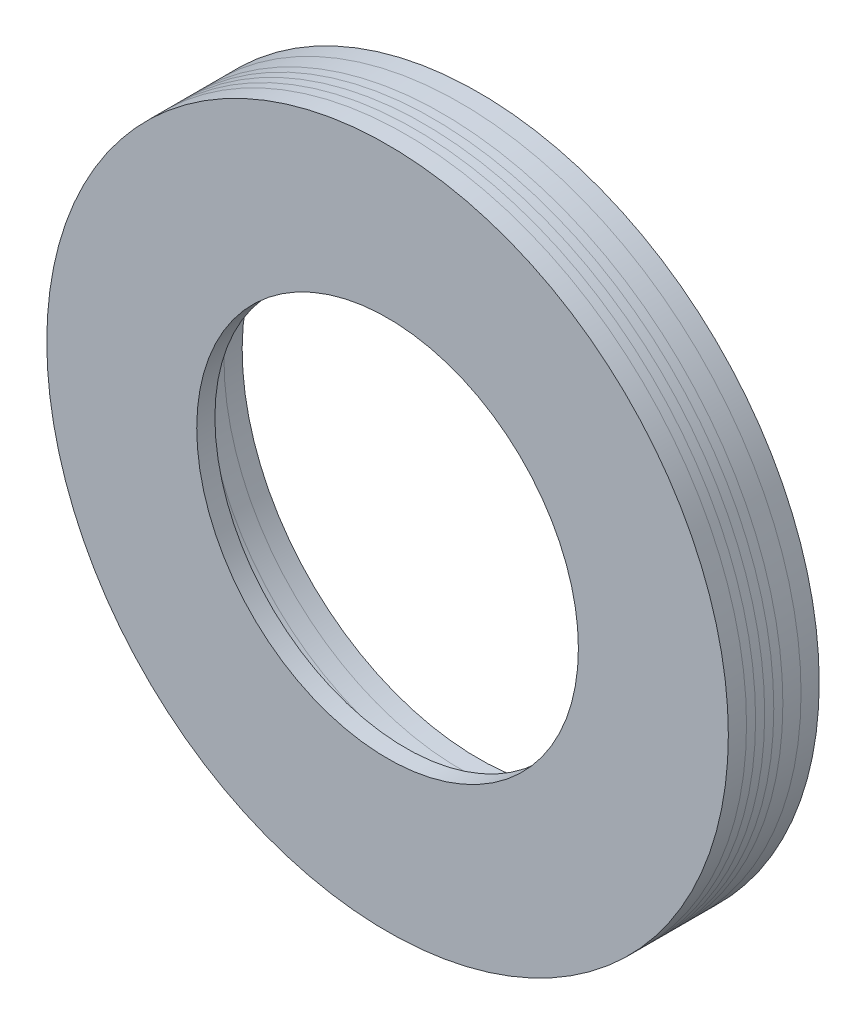
ISO-10303-21;
HEADER;
FILE_DESCRIPTION(('STEP AP214'),'2;1');
FILE_NAME('part.step','',(''),(''),'','','');
FILE_SCHEMA(('AUTOMOTIVE_DESIGN { 1 0 10303 214 1 1 1 1 }'));
ENDSEC;
DATA;
#1=APPLICATION_CONTEXT('core data for automotive mechanical design processes');
#2=APPLICATION_PROTOCOL_DEFINITION('international standard','automotive_design',2000,#1);
#3=PRODUCT_CONTEXT('',#1,'mechanical');
#4=PRODUCT('Part','Part','',(#3));
#5=PRODUCT_RELATED_PRODUCT_CATEGORY('part','',(#4));
#6=PRODUCT_DEFINITION_FORMATION('','',#4);
#7=PRODUCT_DEFINITION_CONTEXT('part definition',#1,'design');
#8=PRODUCT_DEFINITION('design','',#6,#7);
#9=PRODUCT_DEFINITION_SHAPE('','',#8);
#10=(LENGTH_UNIT() NAMED_UNIT(*) SI_UNIT(.MILLI.,.METRE.));
#11=(NAMED_UNIT(*) PLANE_ANGLE_UNIT() SI_UNIT($,.RADIAN.));
#12=(NAMED_UNIT(*) SI_UNIT($,.STERADIAN.) SOLID_ANGLE_UNIT());
#13=UNCERTAINTY_MEASURE_WITH_UNIT(LENGTH_MEASURE(1.E-05),#10,'distance_accuracy_value','');
#14=(GEOMETRIC_REPRESENTATION_CONTEXT(3) GLOBAL_UNCERTAINTY_ASSIGNED_CONTEXT((#13)) GLOBAL_UNIT_ASSIGNED_CONTEXT((#10,
#11,#12)) REPRESENTATION_CONTEXT('',''));
#15=CARTESIAN_POINT('',(0.,0.,0.));
#16=DIRECTION('',(0.,0.,1.));
#17=DIRECTION('',(1.,0.,0.));
#18=AXIS2_PLACEMENT_3D('',#15,#16,#17);
#19=CARTESIAN_POINT('',(0.,0.,5.));
#20=DIRECTION('',(0.,0.,1.));
#21=DIRECTION('',(1.,0.,0.));
#22=AXIS2_PLACEMENT_3D('',#19,#20,#21);
#23=PLANE('',#22);
#24=CARTESIAN_POINT('',(0.,0.,5.));
#25=DIRECTION('',(0.,0.,1.));
#26=DIRECTION('',(1.,0.,0.));
#27=AXIS2_PLACEMENT_3D('',#24,#25,#26);
#28=CIRCLE('',#27,18.75);
#29=CARTESIAN_POINT('',(18.75,0.,5.));
#30=VERTEX_POINT('',#29);
#31=EDGE_CURVE('E11',#30,#30,#28,.T.);
#32=ORIENTED_EDGE('',*,*,#31,.T.);
#33=EDGE_LOOP('',(#32));
#34=FACE_BOUND('',#33,.T.);
#35=CARTESIAN_POINT('',(0.,0.,5.));
#36=DIRECTION('',(0.,0.,1.));
#37=DIRECTION('',(1.,0.,0.));
#38=AXIS2_PLACEMENT_3D('',#35,#36,#37);
#39=CIRCLE('',#38,10.5);
#40=CARTESIAN_POINT('',(10.5,0.,5.));
#41=VERTEX_POINT('',#40);
#42=EDGE_CURVE('E56',#41,#41,#39,.T.);
#43=ORIENTED_EDGE('',*,*,#42,.F.);
#44=EDGE_LOOP('',(#43));
#45=FACE_BOUND('',#44,.T.);
#46=ADVANCED_FACE('F45',(#34,#45),#23,.T.);
#47=CARTESIAN_POINT('',(0.,0.,4.));
#48=DIRECTION('',(0.,0.,1.));
#49=DIRECTION('',(1.,0.,0.));
#50=AXIS2_PLACEMENT_3D('',#47,#48,#49);
#51=PLANE('',#50);
#52=CARTESIAN_POINT('',(0.,0.,4.));
#53=DIRECTION('',(0.,0.,1.));
#54=DIRECTION('',(1.,0.,0.));
#55=AXIS2_PLACEMENT_3D('',#52,#53,#54);
#56=CIRCLE('',#55,18.75);
#57=CARTESIAN_POINT('',(18.75,0.,4.));
#58=VERTEX_POINT('',#57);
#59=EDGE_CURVE('E49',#58,#58,#56,.T.);
#60=ORIENTED_EDGE('',*,*,#59,.F.);
#61=EDGE_LOOP('',(#60));
#62=FACE_BOUND('',#61,.T.);
#63=CARTESIAN_POINT('',(0.,0.,4.));
#64=DIRECTION('',(0.,0.,1.));
#65=DIRECTION('',(1.,0.,0.));
#66=AXIS2_PLACEMENT_3D('',#63,#64,#65);
#67=CIRCLE('',#66,10.5);
#68=CARTESIAN_POINT('',(10.5,0.,4.));
#69=VERTEX_POINT('',#68);
#70=EDGE_CURVE('E58',#69,#69,#67,.T.);
#71=ORIENTED_EDGE('',*,*,#70,.T.);
#72=EDGE_LOOP('',(#71));
#73=FACE_BOUND('',#72,.T.);
#74=ADVANCED_FACE('F68',(#62,#73),#51,.F.);
#75=CARTESIAN_POINT('',(0.,0.,5.));
#76=DIRECTION('',(0.,0.,-1.));
#77=DIRECTION('',(-1.,0.,0.));
#78=AXIS2_PLACEMENT_3D('',#75,#76,#77);
#79=CYLINDRICAL_SURFACE('',#78,18.75);
#80=ORIENTED_EDGE('',*,*,#31,.F.);
#81=EDGE_LOOP('',(#80));
#82=FACE_BOUND('',#81,.T.);
#83=ORIENTED_EDGE('',*,*,#59,.T.);
#84=EDGE_LOOP('',(#83));
#85=FACE_BOUND('',#84,.T.);
#86=ADVANCED_FACE('F47',(#82,#85),#79,.T.);
#87=CARTESIAN_POINT('',(0.,0.,5.));
#88=DIRECTION('',(0.,0.,-1.));
#89=DIRECTION('',(-1.,0.,0.));
#90=AXIS2_PLACEMENT_3D('',#87,#88,#89);
#91=CYLINDRICAL_SURFACE('',#90,10.5);
#92=ORIENTED_EDGE('',*,*,#42,.T.);
#93=EDGE_LOOP('',(#92));
#94=FACE_BOUND('',#93,.T.);
#95=ORIENTED_EDGE('',*,*,#70,.F.);
#96=EDGE_LOOP('',(#95));
#97=FACE_BOUND('',#96,.T.);
#98=ADVANCED_FACE('F64',(#94,#97),#91,.F.);
#99=CLOSED_SHELL('',(#46,#74,#86,#98));
#100=MANIFOLD_SOLID_BREP('B2',#99);
#101=CARTESIAN_POINT('',(-18.75,-18.76,3.5));
#102=DIRECTION('',(0.,0.,1.));
#103=DIRECTION('',(1.,0.,0.));
#104=AXIS2_PLACEMENT_3D('',#101,#102,#103);
#105=PLANE('',#104);
#106=CARTESIAN_POINT('',(0.,0.,3.5));
#107=DIRECTION('',(0.,0.,1.));
#108=DIRECTION('',(1.,0.,0.));
#109=AXIS2_PLACEMENT_3D('',#106,#107,#108);
#110=CIRCLE('',#109,13.);
#111=CARTESIAN_POINT('',(-4.5,12.1963109176505,3.5));
#112=VERTEX_POINT('',#111);
#113=CARTESIAN_POINT('',(4.5,12.1963109176505,3.5));
#114=VERTEX_POINT('',#113);
#115=EDGE_CURVE('E194',#112,#114,#110,.T.);
#116=ORIENTED_EDGE('',*,*,#115,.T.);
#117=DIRECTION('',(0.,1.,0.));
#118=VECTOR('',#117,1.);
#119=CARTESIAN_POINT('',(4.5,16.5,3.5));
#120=LINE('',#119,#118);
#121=CARTESIAN_POINT('',(4.5,16.5,3.5));
#122=VERTEX_POINT('',#121);
#123=EDGE_CURVE('E178',#114,#122,#120,.T.);
#124=ORIENTED_EDGE('',*,*,#123,.T.);
#125=DIRECTION('',(-1.,0.,0.));
#126=VECTOR('',#125,1.);
#127=CARTESIAN_POINT('',(-4.5,16.5,3.5));
#128=LINE('',#127,#126);
#129=CARTESIAN_POINT('',(-4.5,16.5,3.5));
#130=VERTEX_POINT('',#129);
#131=EDGE_CURVE('E174',#122,#130,#128,.T.);
#132=ORIENTED_EDGE('',*,*,#131,.T.);
#133=DIRECTION('',(0.,-1.,0.));
#134=VECTOR('',#133,1.);
#135=CARTESIAN_POINT('',(-4.5,16.5,3.5));
#136=LINE('',#135,#134);
#137=EDGE_CURVE('E164',#130,#112,#136,.T.);
#138=ORIENTED_EDGE('',*,*,#137,.T.);
#139=EDGE_LOOP('',(#116,#124,#132,#138));
#140=FACE_BOUND('',#139,.T.);
#141=CARTESIAN_POINT('',(0.,0.,3.5));
#142=DIRECTION('',(0.,0.,1.));
#143=DIRECTION('',(1.,0.,0.));
#144=AXIS2_PLACEMENT_3D('',#141,#142,#143);
#145=CIRCLE('',#144,18.75);
#146=CARTESIAN_POINT('',(18.75,0.,3.5));
#147=VERTEX_POINT('',#146);
#148=EDGE_CURVE('E126',#147,#147,#145,.T.);
#149=ORIENTED_EDGE('',*,*,#148,.F.);
#150=EDGE_LOOP('',(#149));
#151=FACE_BOUND('',#150,.T.);
#152=ADVANCED_FACE('F122',(#140,#151),#105,.F.);
#153=CARTESIAN_POINT('',(4.5,16.5,4.));
#154=DIRECTION('',(-1.,0.,0.));
#155=DIRECTION('',(0.,-1.,0.));
#156=AXIS2_PLACEMENT_3D('',#153,#154,#155);
#157=PLANE('',#156);
#158=ORIENTED_EDGE('',*,*,#123,.F.);
#159=DIRECTION('',(0.,0.,-1.));
#160=VECTOR('',#159,1.);
#161=CARTESIAN_POINT('',(4.5,12.1963109176505,4.));
#162=LINE('',#161,#160);
#163=CARTESIAN_POINT('',(4.5,12.1963109176505,4.));
#164=VERTEX_POINT('',#163);
#165=EDGE_CURVE('E189',#164,#114,#162,.T.);
#166=ORIENTED_EDGE('',*,*,#165,.F.);
#167=DIRECTION('',(0.,1.,0.));
#168=VECTOR('',#167,1.);
#169=CARTESIAN_POINT('',(4.5,16.5,4.));
#170=LINE('',#169,#168);
#171=CARTESIAN_POINT('',(4.5,16.5,4.));
#172=VERTEX_POINT('',#171);
#173=EDGE_CURVE('E131',#164,#172,#170,.T.);
#174=ORIENTED_EDGE('',*,*,#173,.T.);
#175=DIRECTION('',(0.,0.,-1.));
#176=VECTOR('',#175,1.);
#177=CARTESIAN_POINT('',(4.5,16.5,4.));
#178=LINE('',#177,#176);
#179=EDGE_CURVE('E185',#172,#122,#178,.T.);
#180=ORIENTED_EDGE('',*,*,#179,.T.);
#181=EDGE_LOOP('',(#158,#166,#174,#180));
#182=FACE_BOUND('',#181,.T.);
#183=ADVANCED_FACE('F215',(#182),#157,.T.);
#184=CARTESIAN_POINT('',(0.,0.,4.));
#185=DIRECTION('',(0.,0.,-1.));
#186=DIRECTION('',(-1.,0.,0.));
#187=AXIS2_PLACEMENT_3D('',#184,#185,#186);
#188=CYLINDRICAL_SURFACE('',#187,13.);
#189=ORIENTED_EDGE('',*,*,#115,.F.);
#190=DIRECTION('',(0.,0.,-1.));
#191=VECTOR('',#190,1.);
#192=CARTESIAN_POINT('',(-4.5,12.1963109176505,4.));
#193=LINE('',#192,#191);
#194=CARTESIAN_POINT('',(-4.5,12.1963109176505,4.));
#195=VERTEX_POINT('',#194);
#196=EDGE_CURVE('E170',#195,#112,#193,.T.);
#197=ORIENTED_EDGE('',*,*,#196,.F.);
#198=CARTESIAN_POINT('',(0.,0.,4.));
#199=DIRECTION('',(0.,0.,1.));
#200=DIRECTION('',(1.,0.,0.));
#201=AXIS2_PLACEMENT_3D('',#198,#199,#200);
#202=CIRCLE('',#201,13.);
#203=EDGE_CURVE('E43',#195,#164,#202,.T.);
#204=ORIENTED_EDGE('',*,*,#203,.T.);
#205=ORIENTED_EDGE('',*,*,#165,.T.);
#206=EDGE_LOOP('',(#189,#197,#204,#205));
#207=FACE_BOUND('',#206,.T.);
#208=ADVANCED_FACE('F206',(#207),#188,.F.);
#209=CARTESIAN_POINT('',(0.,0.,4.));
#210=DIRECTION('',(0.,0.,1.));
#211=DIRECTION('',(1.,0.,0.));
#212=AXIS2_PLACEMENT_3D('',#209,#210,#211);
#213=PLANE('',#212);
#214=CARTESIAN_POINT('',(0.,0.,4.));
#215=DIRECTION('',(0.,0.,1.));
#216=DIRECTION('',(1.,0.,0.));
#217=AXIS2_PLACEMENT_3D('',#214,#215,#216);
#218=CIRCLE('',#217,18.75);
#219=CARTESIAN_POINT('',(18.75,0.,4.));
#220=VERTEX_POINT('',#219);
#221=EDGE_CURVE('E192',#220,#220,#218,.T.);
#222=ORIENTED_EDGE('',*,*,#221,.T.);
#223=EDGE_LOOP('',(#222));
#224=FACE_BOUND('',#223,.T.);
#225=ORIENTED_EDGE('',*,*,#173,.F.);
#226=ORIENTED_EDGE('',*,*,#203,.F.);
#227=DIRECTION('',(0.,-1.,0.));
#228=VECTOR('',#227,1.);
#229=CARTESIAN_POINT('',(-4.5,16.5,4.));
#230=LINE('',#229,#228);
#231=CARTESIAN_POINT('',(-4.5,16.5,4.));
#232=VERTEX_POINT('',#231);
#233=EDGE_CURVE('E187',#232,#195,#230,.T.);
#234=ORIENTED_EDGE('',*,*,#233,.F.);
#235=DIRECTION('',(-1.,0.,0.));
#236=VECTOR('',#235,1.);
#237=CARTESIAN_POINT('',(-4.5,16.5,4.));
#238=LINE('',#237,#236);
#239=EDGE_CURVE('E183',#172,#232,#238,.T.);
#240=ORIENTED_EDGE('',*,*,#239,.F.);
#241=EDGE_LOOP('',(#225,#226,#234,#240));
#242=FACE_BOUND('',#241,.T.);
#243=ADVANCED_FACE('F207',(#224,#242),#213,.T.);
#244=CARTESIAN_POINT('',(-4.5,16.5,4.));
#245=DIRECTION('',(0.,-1.,0.));
#246=DIRECTION('',(0.,0.,-1.));
#247=AXIS2_PLACEMENT_3D('',#244,#245,#246);
#248=PLANE('',#247);
#249=ORIENTED_EDGE('',*,*,#131,.F.);
#250=ORIENTED_EDGE('',*,*,#179,.F.);
#251=ORIENTED_EDGE('',*,*,#239,.T.);
#252=DIRECTION('',(0.,0.,-1.));
#253=VECTOR('',#252,1.);
#254=CARTESIAN_POINT('',(-4.5,16.5,4.));
#255=LINE('',#254,#253);
#256=EDGE_CURVE('E168',#232,#130,#255,.T.);
#257=ORIENTED_EDGE('',*,*,#256,.T.);
#258=EDGE_LOOP('',(#249,#250,#251,#257));
#259=FACE_BOUND('',#258,.T.);
#260=ADVANCED_FACE('F181',(#259),#248,.T.);
#261=CARTESIAN_POINT('',(-4.5,16.5,4.));
#262=DIRECTION('',(1.,0.,0.));
#263=DIRECTION('',(0.,1.,0.));
#264=AXIS2_PLACEMENT_3D('',#261,#262,#263);
#265=PLANE('',#264);
#266=ORIENTED_EDGE('',*,*,#137,.F.);
#267=ORIENTED_EDGE('',*,*,#256,.F.);
#268=ORIENTED_EDGE('',*,*,#233,.T.);
#269=ORIENTED_EDGE('',*,*,#196,.T.);
#270=EDGE_LOOP('',(#266,#267,#268,#269));
#271=FACE_BOUND('',#270,.T.);
#272=ADVANCED_FACE('F166',(#271),#265,.T.);
#273=CARTESIAN_POINT('',(0.,0.,4.));
#274=DIRECTION('',(0.,0.,-1.));
#275=DIRECTION('',(-1.,0.,0.));
#276=AXIS2_PLACEMENT_3D('',#273,#274,#275);
#277=CYLINDRICAL_SURFACE('',#276,18.75);
#278=ORIENTED_EDGE('',*,*,#148,.T.);
#279=EDGE_LOOP('',(#278));
#280=FACE_BOUND('',#279,.T.);
#281=ORIENTED_EDGE('',*,*,#221,.F.);
#282=EDGE_LOOP('',(#281));
#283=FACE_BOUND('',#282,.T.);
#284=ADVANCED_FACE('F124',(#280,#283),#277,.T.);
#285=CLOSED_SHELL('',(#152,#183,#208,#243,#260,#272,#284));
#286=MANIFOLD_SOLID_BREP('B6',#285);
#287=CARTESIAN_POINT('',(-18.75,-18.76,3.));
#288=DIRECTION('',(0.,0.,1.));
#289=DIRECTION('',(1.,0.,0.));
#290=AXIS2_PLACEMENT_3D('',#287,#288,#289);
#291=PLANE('',#290);
#292=CARTESIAN_POINT('',(0.,0.,3.));
#293=DIRECTION('',(0.,0.,1.));
#294=DIRECTION('',(1.,0.,0.));
#295=AXIS2_PLACEMENT_3D('',#292,#293,#294);
#296=CIRCLE('',#295,13.);
#297=CARTESIAN_POINT('',(-4.5,12.1963109176505,3.));
#298=VERTEX_POINT('',#297);
#299=CARTESIAN_POINT('',(4.5,12.1963109176505,3.));
#300=VERTEX_POINT('',#299);
#301=EDGE_CURVE('E352',#298,#300,#296,.T.);
#302=ORIENTED_EDGE('',*,*,#301,.T.);
#303=DIRECTION('',(0.,1.,0.));
#304=VECTOR('',#303,1.);
#305=CARTESIAN_POINT('',(4.5,16.5,3.));
#306=LINE('',#305,#304);
#307=CARTESIAN_POINT('',(4.5,16.5,3.));
#308=VERTEX_POINT('',#307);
#309=EDGE_CURVE('E330',#300,#308,#306,.T.);
#310=ORIENTED_EDGE('',*,*,#309,.T.);
#311=DIRECTION('',(-1.,0.,0.));
#312=VECTOR('',#311,1.);
#313=CARTESIAN_POINT('',(-4.5,16.5,3.));
#314=LINE('',#313,#312);
#315=CARTESIAN_POINT('',(-4.5,16.5,3.));
#316=VERTEX_POINT('',#315);
#317=EDGE_CURVE('E326',#308,#316,#314,.T.);
#318=ORIENTED_EDGE('',*,*,#317,.T.);
#319=DIRECTION('',(0.,-1.,0.));
#320=VECTOR('',#319,1.);
#321=CARTESIAN_POINT('',(-4.5,16.5,3.));
#322=LINE('',#321,#320);
#323=EDGE_CURVE('E318',#316,#298,#322,.T.);
#324=ORIENTED_EDGE('',*,*,#323,.T.);
#325=EDGE_LOOP('',(#302,#310,#318,#324));
#326=FACE_BOUND('',#325,.T.);
#327=CARTESIAN_POINT('',(0.,0.,3.));
#328=DIRECTION('',(0.,0.,1.));
#329=DIRECTION('',(1.,0.,0.));
#330=AXIS2_PLACEMENT_3D('',#327,#328,#329);
#331=CIRCLE('',#330,18.75);
#332=CARTESIAN_POINT('',(18.75,0.,3.));
#333=VERTEX_POINT('',#332);
#334=EDGE_CURVE('E353',#333,#333,#331,.T.);
#335=ORIENTED_EDGE('',*,*,#334,.F.);
#336=EDGE_LOOP('',(#335));
#337=FACE_BOUND('',#336,.T.);
#338=ADVANCED_FACE('F280',(#326,#337),#291,.F.);
#339=CARTESIAN_POINT('',(-18.75,-18.76,3.5));
#340=DIRECTION('',(0.,0.,1.));
#341=DIRECTION('',(1.,0.,0.));
#342=AXIS2_PLACEMENT_3D('',#339,#340,#341);
#343=PLANE('',#342);
#344=CARTESIAN_POINT('',(0.,0.,3.5));
#345=DIRECTION('',(0.,0.,1.));
#346=DIRECTION('',(1.,0.,0.));
#347=AXIS2_PLACEMENT_3D('',#344,#345,#346);
#348=CIRCLE('',#347,18.75);
#349=CARTESIAN_POINT('',(18.75,0.,3.5));
#350=VERTEX_POINT('',#349);
#351=EDGE_CURVE('E284',#350,#350,#348,.T.);
#352=ORIENTED_EDGE('',*,*,#351,.T.);
#353=EDGE_LOOP('',(#352));
#354=FACE_BOUND('',#353,.T.);
#355=CARTESIAN_POINT('',(0.,0.,3.5));
#356=DIRECTION('',(0.,0.,1.));
#357=DIRECTION('',(1.,0.,0.));
#358=AXIS2_PLACEMENT_3D('',#355,#356,#357);
#359=CIRCLE('',#358,13.);
#360=CARTESIAN_POINT('',(-4.5,12.1963109176505,3.5));
#361=VERTEX_POINT('',#360);
#362=CARTESIAN_POINT('',(4.5,12.1963109176505,3.5));
#363=VERTEX_POINT('',#362);
#364=EDGE_CURVE('E355',#361,#363,#359,.T.);
#365=ORIENTED_EDGE('',*,*,#364,.F.);
#366=DIRECTION('',(0.,-1.,0.));
#367=VECTOR('',#366,1.);
#368=CARTESIAN_POINT('',(-4.5,16.5,3.5));
#369=LINE('',#368,#367);
#370=CARTESIAN_POINT('',(-4.5,16.5,3.5));
#371=VERTEX_POINT('',#370);
#372=EDGE_CURVE('E297',#371,#361,#369,.T.);
#373=ORIENTED_EDGE('',*,*,#372,.F.);
#374=DIRECTION('',(-1.,0.,0.));
#375=VECTOR('',#374,1.);
#376=CARTESIAN_POINT('',(-4.5,16.5,3.5));
#377=LINE('',#376,#375);
#378=CARTESIAN_POINT('',(4.5,16.5,3.5));
#379=VERTEX_POINT('',#378);
#380=EDGE_CURVE('E336',#379,#371,#377,.T.);
#381=ORIENTED_EDGE('',*,*,#380,.F.);
#382=DIRECTION('',(0.,1.,0.));
#383=VECTOR('',#382,1.);
#384=CARTESIAN_POINT('',(4.5,16.5,3.5));
#385=LINE('',#384,#383);
#386=EDGE_CURVE('E347',#363,#379,#385,.T.);
#387=ORIENTED_EDGE('',*,*,#386,.F.);
#388=EDGE_LOOP('',(#365,#373,#381,#387));
#389=FACE_BOUND('',#388,.T.);
#390=ADVANCED_FACE('F362',(#354,#389),#343,.T.);
#391=CARTESIAN_POINT('',(4.5,16.5,4.));
#392=DIRECTION('',(-1.,0.,0.));
#393=DIRECTION('',(0.,-1.,0.));
#394=AXIS2_PLACEMENT_3D('',#391,#392,#393);
#395=PLANE('',#394);
#396=DIRECTION('',(0.,0.,-1.));
#397=VECTOR('',#396,1.);
#398=CARTESIAN_POINT('',(4.5,12.1963109176505,4.));
#399=LINE('',#398,#397);
#400=EDGE_CURVE('E339',#363,#300,#399,.T.);
#401=ORIENTED_EDGE('',*,*,#400,.F.);
#402=ORIENTED_EDGE('',*,*,#386,.T.);
#403=DIRECTION('',(0.,0.,-1.));
#404=VECTOR('',#403,1.);
#405=CARTESIAN_POINT('',(4.5,16.5,4.));
#406=LINE('',#405,#404);
#407=EDGE_CURVE('E337',#379,#308,#406,.T.);
#408=ORIENTED_EDGE('',*,*,#407,.T.);
#409=ORIENTED_EDGE('',*,*,#309,.F.);
#410=EDGE_LOOP('',(#401,#402,#408,#409));
#411=FACE_BOUND('',#410,.T.);
#412=ADVANCED_FACE('F365',(#411),#395,.T.);
#413=CARTESIAN_POINT('',(0.,0.,4.));
#414=DIRECTION('',(0.,0.,-1.));
#415=DIRECTION('',(-1.,0.,0.));
#416=AXIS2_PLACEMENT_3D('',#413,#414,#415);
#417=CYLINDRICAL_SURFACE('',#416,13.);
#418=DIRECTION('',(0.,0.,-1.));
#419=VECTOR('',#418,1.);
#420=CARTESIAN_POINT('',(-4.5,12.1963109176505,4.));
#421=LINE('',#420,#419);
#422=EDGE_CURVE('E120',#361,#298,#421,.T.);
#423=ORIENTED_EDGE('',*,*,#422,.F.);
#424=ORIENTED_EDGE('',*,*,#364,.T.);
#425=ORIENTED_EDGE('',*,*,#400,.T.);
#426=ORIENTED_EDGE('',*,*,#301,.F.);
#427=EDGE_LOOP('',(#423,#424,#425,#426));
#428=FACE_BOUND('',#427,.T.);
#429=ADVANCED_FACE('F370',(#428),#417,.F.);
#430=CARTESIAN_POINT('',(-4.5,16.5,4.));
#431=DIRECTION('',(0.,-1.,0.));
#432=DIRECTION('',(0.,0.,-1.));
#433=AXIS2_PLACEMENT_3D('',#430,#431,#432);
#434=PLANE('',#433);
#435=ORIENTED_EDGE('',*,*,#407,.F.);
#436=ORIENTED_EDGE('',*,*,#380,.T.);
#437=DIRECTION('',(0.,0.,-1.));
#438=VECTOR('',#437,1.);
#439=CARTESIAN_POINT('',(-4.5,16.5,4.));
#440=LINE('',#439,#438);
#441=EDGE_CURVE('E289',#371,#316,#440,.T.);
#442=ORIENTED_EDGE('',*,*,#441,.T.);
#443=ORIENTED_EDGE('',*,*,#317,.F.);
#444=EDGE_LOOP('',(#435,#436,#442,#443));
#445=FACE_BOUND('',#444,.T.);
#446=ADVANCED_FACE('F335',(#445),#434,.T.);
#447=CARTESIAN_POINT('',(-4.5,16.5,4.));
#448=DIRECTION('',(1.,0.,0.));
#449=DIRECTION('',(0.,1.,0.));
#450=AXIS2_PLACEMENT_3D('',#447,#448,#449);
#451=PLANE('',#450);
#452=ORIENTED_EDGE('',*,*,#441,.F.);
#453=ORIENTED_EDGE('',*,*,#372,.T.);
#454=ORIENTED_EDGE('',*,*,#422,.T.);
#455=ORIENTED_EDGE('',*,*,#323,.F.);
#456=EDGE_LOOP('',(#452,#453,#454,#455));
#457=FACE_BOUND('',#456,.T.);
#458=ADVANCED_FACE('F320',(#457),#451,.T.);
#459=CARTESIAN_POINT('',(0.,0.,4.));
#460=DIRECTION('',(0.,0.,-1.));
#461=DIRECTION('',(-1.,0.,0.));
#462=AXIS2_PLACEMENT_3D('',#459,#460,#461);
#463=CYLINDRICAL_SURFACE('',#462,18.75);
#464=ORIENTED_EDGE('',*,*,#334,.T.);
#465=EDGE_LOOP('',(#464));
#466=FACE_BOUND('',#465,.T.);
#467=ORIENTED_EDGE('',*,*,#351,.F.);
#468=EDGE_LOOP('',(#467));
#469=FACE_BOUND('',#468,.T.);
#470=ADVANCED_FACE('F282',(#466,#469),#463,.T.);
#471=CLOSED_SHELL('',(#338,#390,#412,#429,#446,#458,#470));
#472=MANIFOLD_SOLID_BREP('B37',#471);
#473=CARTESIAN_POINT('',(-18.75,-18.76,1.));
#474=DIRECTION('',(0.,0.,1.));
#475=DIRECTION('',(1.,0.,0.));
#476=AXIS2_PLACEMENT_3D('',#473,#474,#475);
#477=PLANE('',#476);
#478=CARTESIAN_POINT('',(0.,0.,1.));
#479=DIRECTION('',(0.,0.,1.));
#480=DIRECTION('',(1.,0.,0.));
#481=AXIS2_PLACEMENT_3D('',#478,#479,#480);
#482=CIRCLE('',#481,18.75);
#483=CARTESIAN_POINT('',(18.75,0.,1.));
#484=VERTEX_POINT('',#483);
#485=EDGE_CURVE('E486',#484,#484,#482,.T.);
#486=ORIENTED_EDGE('',*,*,#485,.T.);
#487=EDGE_LOOP('',(#486));
#488=FACE_BOUND('',#487,.T.);
#489=CARTESIAN_POINT('',(0.,0.,1.));
#490=DIRECTION('',(0.,0.,1.));
#491=DIRECTION('',(1.,0.,0.));
#492=AXIS2_PLACEMENT_3D('',#489,#490,#491);
#493=CIRCLE('',#492,13.);
#494=CARTESIAN_POINT('',(-4.5,12.1963109176505,1.));
#495=VERTEX_POINT('',#494);
#496=CARTESIAN_POINT('',(4.5,12.1963109176505,1.));
#497=VERTEX_POINT('',#496);
#498=EDGE_CURVE('E479',#495,#497,#493,.T.);
#499=ORIENTED_EDGE('',*,*,#498,.F.);
#500=DIRECTION('',(0.,-1.,0.));
#501=VECTOR('',#500,1.);
#502=CARTESIAN_POINT('',(-4.5,16.5,1.));
#503=LINE('',#502,#501);
#504=CARTESIAN_POINT('',(-4.5,16.5,1.));
#505=VERTEX_POINT('',#504);
#506=EDGE_CURVE('E493',#505,#495,#503,.T.);
#507=ORIENTED_EDGE('',*,*,#506,.F.);
#508=DIRECTION('',(-1.,0.,0.));
#509=VECTOR('',#508,1.);
#510=CARTESIAN_POINT('',(-4.5,16.5,1.));
#511=LINE('',#510,#509);
#512=CARTESIAN_POINT('',(4.5,16.5,1.));
#513=VERTEX_POINT('',#512);
#514=EDGE_CURVE('E482',#513,#505,#511,.T.);
#515=ORIENTED_EDGE('',*,*,#514,.F.);
#516=DIRECTION('',(0.,1.,0.));
#517=VECTOR('',#516,1.);
#518=CARTESIAN_POINT('',(4.5,16.5,1.));
#519=LINE('',#518,#517);
#520=EDGE_CURVE('E478',#497,#513,#519,.T.);
#521=ORIENTED_EDGE('',*,*,#520,.F.);
#522=EDGE_LOOP('',(#499,#507,#515,#521));
#523=FACE_BOUND('',#522,.T.);
#524=ADVANCED_FACE('F434',(#488,#523),#477,.T.);
#525=CARTESIAN_POINT('',(4.5,16.5,4.));
#526=DIRECTION('',(-1.,0.,0.));
#527=DIRECTION('',(0.,-1.,0.));
#528=AXIS2_PLACEMENT_3D('',#525,#526,#527);
#529=PLANE('',#528);
#530=DIRECTION('',(0.,0.,-1.));
#531=VECTOR('',#530,1.);
#532=CARTESIAN_POINT('',(4.5,12.1963109176505,4.));
#533=LINE('',#532,#531);
#534=CARTESIAN_POINT('',(4.5,12.1963109176505,0.));
#535=VERTEX_POINT('',#534);
#536=EDGE_CURVE('E438',#497,#535,#533,.T.);
#537=ORIENTED_EDGE('',*,*,#536,.F.);
#538=ORIENTED_EDGE('',*,*,#520,.T.);
#539=DIRECTION('',(0.,0.,-1.));
#540=VECTOR('',#539,1.);
#541=CARTESIAN_POINT('',(4.5,16.5,4.));
#542=LINE('',#541,#540);
#543=CARTESIAN_POINT('',(4.5,16.5,0.));
#544=VERTEX_POINT('',#543);
#545=EDGE_CURVE('E457',#513,#544,#542,.T.);
#546=ORIENTED_EDGE('',*,*,#545,.T.);
#547=DIRECTION('',(0.,1.,0.));
#548=VECTOR('',#547,1.);
#549=CARTESIAN_POINT('',(4.5,16.5,0.));
#550=LINE('',#549,#548);
#551=EDGE_CURVE('E443',#535,#544,#550,.T.);
#552=ORIENTED_EDGE('',*,*,#551,.F.);
#553=EDGE_LOOP('',(#537,#538,#546,#552));
#554=FACE_BOUND('',#553,.T.);
#555=ADVANCED_FACE('F488',(#554),#529,.T.);
#556=CARTESIAN_POINT('',(0.,0.,0.));
#557=DIRECTION('',(0.,0.,1.));
#558=DIRECTION('',(1.,0.,0.));
#559=AXIS2_PLACEMENT_3D('',#556,#557,#558);
#560=PLANE('',#559);
#561=CARTESIAN_POINT('',(0.,0.,0.));
#562=DIRECTION('',(0.,0.,1.));
#563=DIRECTION('',(1.,0.,0.));
#564=AXIS2_PLACEMENT_3D('',#561,#562,#563);
#565=CIRCLE('',#564,18.75);
#566=CARTESIAN_POINT('',(18.75,0.,0.));
#567=VERTEX_POINT('',#566);
#568=EDGE_CURVE('E490',#567,#567,#565,.T.);
#569=ORIENTED_EDGE('',*,*,#568,.F.);
#570=EDGE_LOOP('',(#569));
#571=FACE_BOUND('',#570,.T.);
#572=CARTESIAN_POINT('',(0.,0.,0.));
#573=DIRECTION('',(0.,0.,1.));
#574=DIRECTION('',(1.,0.,0.));
#575=AXIS2_PLACEMENT_3D('',#572,#573,#574);
#576=CIRCLE('',#575,13.);
#577=CARTESIAN_POINT('',(-4.5,12.1963109176505,0.));
#578=VERTEX_POINT('',#577);
#579=EDGE_CURVE('E278',#578,#535,#576,.T.);
#580=ORIENTED_EDGE('',*,*,#579,.T.);
#581=ORIENTED_EDGE('',*,*,#551,.T.);
#582=DIRECTION('',(-1.,0.,0.));
#583=VECTOR('',#582,1.);
#584=CARTESIAN_POINT('',(-4.5,16.5,0.));
#585=LINE('',#584,#583);
#586=CARTESIAN_POINT('',(-4.5,16.5,0.));
#587=VERTEX_POINT('',#586);
#588=EDGE_CURVE('E502',#544,#587,#585,.T.);
#589=ORIENTED_EDGE('',*,*,#588,.T.);
#590=DIRECTION('',(0.,-1.,0.));
#591=VECTOR('',#590,1.);
#592=CARTESIAN_POINT('',(-4.5,16.5,0.));
#593=LINE('',#592,#591);
#594=EDGE_CURVE('E499',#587,#578,#593,.T.);
#595=ORIENTED_EDGE('',*,*,#594,.T.);
#596=EDGE_LOOP('',(#580,#581,#589,#595));
#597=FACE_BOUND('',#596,.T.);
#598=ADVANCED_FACE('F517',(#571,#597),#560,.F.);
#599=CARTESIAN_POINT('',(0.,0.,4.));
#600=DIRECTION('',(0.,0.,-1.));
#601=DIRECTION('',(-1.,0.,0.));
#602=AXIS2_PLACEMENT_3D('',#599,#600,#601);
#603=CYLINDRICAL_SURFACE('',#602,13.);
#604=DIRECTION('',(0.,0.,-1.));
#605=VECTOR('',#604,1.);
#606=CARTESIAN_POINT('',(-4.5,12.1963109176505,4.));
#607=LINE('',#606,#605);
#608=EDGE_CURVE('E485',#495,#578,#607,.T.);
#609=ORIENTED_EDGE('',*,*,#608,.F.);
#610=ORIENTED_EDGE('',*,*,#498,.T.);
#611=ORIENTED_EDGE('',*,*,#536,.T.);
#612=ORIENTED_EDGE('',*,*,#579,.F.);
#613=EDGE_LOOP('',(#609,#610,#611,#612));
#614=FACE_BOUND('',#613,.T.);
#615=ADVANCED_FACE('F484',(#614),#603,.F.);
#616=CARTESIAN_POINT('',(-4.5,16.5,4.));
#617=DIRECTION('',(0.,-1.,0.));
#618=DIRECTION('',(0.,0.,-1.));
#619=AXIS2_PLACEMENT_3D('',#616,#617,#618);
#620=PLANE('',#619);
#621=ORIENTED_EDGE('',*,*,#545,.F.);
#622=ORIENTED_EDGE('',*,*,#514,.T.);
#623=DIRECTION('',(0.,0.,-1.));
#624=VECTOR('',#623,1.);
#625=CARTESIAN_POINT('',(-4.5,16.5,4.));
#626=LINE('',#625,#624);
#627=EDGE_CURVE('E491',#505,#587,#626,.T.);
#628=ORIENTED_EDGE('',*,*,#627,.T.);
#629=ORIENTED_EDGE('',*,*,#588,.F.);
#630=EDGE_LOOP('',(#621,#622,#628,#629));
#631=FACE_BOUND('',#630,.T.);
#632=ADVANCED_FACE('F513',(#631),#620,.T.);
#633=CARTESIAN_POINT('',(-4.5,16.5,4.));
#634=DIRECTION('',(1.,0.,0.));
#635=DIRECTION('',(0.,1.,0.));
#636=AXIS2_PLACEMENT_3D('',#633,#634,#635);
#637=PLANE('',#636);
#638=ORIENTED_EDGE('',*,*,#627,.F.);
#639=ORIENTED_EDGE('',*,*,#506,.T.);
#640=ORIENTED_EDGE('',*,*,#608,.T.);
#641=ORIENTED_EDGE('',*,*,#594,.F.);
#642=EDGE_LOOP('',(#638,#639,#640,#641));
#643=FACE_BOUND('',#642,.T.);
#644=ADVANCED_FACE('F515',(#643),#637,.T.);
#645=CARTESIAN_POINT('',(0.,0.,4.));
#646=DIRECTION('',(0.,0.,-1.));
#647=DIRECTION('',(-1.,0.,0.));
#648=AXIS2_PLACEMENT_3D('',#645,#646,#647);
#649=CYLINDRICAL_SURFACE('',#648,18.75);
#650=ORIENTED_EDGE('',*,*,#568,.T.);
#651=EDGE_LOOP('',(#650));
#652=FACE_BOUND('',#651,.T.);
#653=ORIENTED_EDGE('',*,*,#485,.F.);
#654=EDGE_LOOP('',(#653));
#655=FACE_BOUND('',#654,.T.);
#656=ADVANCED_FACE('F436',(#652,#655),#649,.T.);
#657=CLOSED_SHELL('',(#524,#555,#598,#615,#632,#644,#656));
#658=MANIFOLD_SOLID_BREP('B114',#657);
#659=CARTESIAN_POINT('',(-18.75,-18.76,2.5));
#660=DIRECTION('',(0.,0.,1.));
#661=DIRECTION('',(1.,0.,0.));
#662=AXIS2_PLACEMENT_3D('',#659,#660,#661);
#663=PLANE('',#662);
#664=CARTESIAN_POINT('',(0.,0.,2.5));
#665=DIRECTION('',(0.,0.,1.));
#666=DIRECTION('',(1.,0.,0.));
#667=AXIS2_PLACEMENT_3D('',#664,#665,#666);
#668=CIRCLE('',#667,13.);
#669=CARTESIAN_POINT('',(-4.5,12.1963109176505,2.5));
#670=VERTEX_POINT('',#669);
#671=CARTESIAN_POINT('',(4.5,12.1963109176505,2.5));
#672=VERTEX_POINT('',#671);
#673=EDGE_CURVE('E666',#670,#672,#668,.T.);
#674=ORIENTED_EDGE('',*,*,#673,.T.);
#675=DIRECTION('',(0.,1.,0.));
#676=VECTOR('',#675,1.);
#677=CARTESIAN_POINT('',(4.5,16.5,2.5));
#678=LINE('',#677,#676);
#679=CARTESIAN_POINT('',(4.5,16.5,2.5));
#680=VERTEX_POINT('',#679);
#681=EDGE_CURVE('E642',#672,#680,#678,.T.);
#682=ORIENTED_EDGE('',*,*,#681,.T.);
#683=DIRECTION('',(-1.,0.,0.));
#684=VECTOR('',#683,1.);
#685=CARTESIAN_POINT('',(-4.5,16.5,2.5));
#686=LINE('',#685,#684);
#687=CARTESIAN_POINT('',(-4.5,16.5,2.5));
#688=VERTEX_POINT('',#687);
#689=EDGE_CURVE('E638',#680,#688,#686,.T.);
#690=ORIENTED_EDGE('',*,*,#689,.T.);
#691=DIRECTION('',(0.,-1.,0.));
#692=VECTOR('',#691,1.);
#693=CARTESIAN_POINT('',(-4.5,16.5,2.5));
#694=LINE('',#693,#692);
#695=EDGE_CURVE('E630',#688,#670,#694,.T.);
#696=ORIENTED_EDGE('',*,*,#695,.T.);
#697=EDGE_LOOP('',(#674,#682,#690,#696));
#698=FACE_BOUND('',#697,.T.);
#699=CARTESIAN_POINT('',(0.,0.,2.5));
#700=DIRECTION('',(0.,0.,1.));
#701=DIRECTION('',(1.,0.,0.));
#702=AXIS2_PLACEMENT_3D('',#699,#700,#701);
#703=CIRCLE('',#702,18.75);
#704=CARTESIAN_POINT('',(18.75,0.,2.5));
#705=VERTEX_POINT('',#704);
#706=EDGE_CURVE('E662',#705,#705,#703,.T.);
#707=ORIENTED_EDGE('',*,*,#706,.F.);
#708=EDGE_LOOP('',(#707));
#709=FACE_BOUND('',#708,.T.);
#710=ADVANCED_FACE('F592',(#698,#709),#663,.F.);
#711=CARTESIAN_POINT('',(-18.75,-18.76,3.));
#712=DIRECTION('',(0.,0.,1.));
#713=DIRECTION('',(1.,0.,0.));
#714=AXIS2_PLACEMENT_3D('',#711,#712,#713);
#715=PLANE('',#714);
#716=CARTESIAN_POINT('',(0.,0.,3.));
#717=DIRECTION('',(0.,0.,1.));
#718=DIRECTION('',(1.,0.,0.));
#719=AXIS2_PLACEMENT_3D('',#716,#717,#718);
#720=CIRCLE('',#719,18.75);
#721=CARTESIAN_POINT('',(18.75,0.,3.));
#722=VERTEX_POINT('',#721);
#723=EDGE_CURVE('E596',#722,#722,#720,.T.);
#724=ORIENTED_EDGE('',*,*,#723,.T.);
#725=EDGE_LOOP('',(#724));
#726=FACE_BOUND('',#725,.T.);
#727=CARTESIAN_POINT('',(0.,0.,3.));
#728=DIRECTION('',(0.,0.,1.));
#729=DIRECTION('',(1.,0.,0.));
#730=AXIS2_PLACEMENT_3D('',#727,#728,#729);
#731=CIRCLE('',#730,13.);
#732=CARTESIAN_POINT('',(-4.5,12.1963109176505,3.));
#733=VERTEX_POINT('',#732);
#734=CARTESIAN_POINT('',(4.5,12.1963109176505,3.));
#735=VERTEX_POINT('',#734);
#736=EDGE_CURVE('E665',#733,#735,#731,.T.);
#737=ORIENTED_EDGE('',*,*,#736,.F.);
#738=DIRECTION('',(0.,-1.,0.));
#739=VECTOR('',#738,1.);
#740=CARTESIAN_POINT('',(-4.5,16.5,3.));
#741=LINE('',#740,#739);
#742=CARTESIAN_POINT('',(-4.5,16.5,3.));
#743=VERTEX_POINT('',#742);
#744=EDGE_CURVE('E609',#743,#733,#741,.T.);
#745=ORIENTED_EDGE('',*,*,#744,.F.);
#746=DIRECTION('',(-1.,0.,0.));
#747=VECTOR('',#746,1.);
#748=CARTESIAN_POINT('',(-4.5,16.5,3.));
#749=LINE('',#748,#747);
#750=CARTESIAN_POINT('',(4.5,16.5,3.));
#751=VERTEX_POINT('',#750);
#752=EDGE_CURVE('E648',#751,#743,#749,.T.);
#753=ORIENTED_EDGE('',*,*,#752,.F.);
#754=DIRECTION('',(0.,1.,0.));
#755=VECTOR('',#754,1.);
#756=CARTESIAN_POINT('',(4.5,16.5,3.));
#757=LINE('',#756,#755);
#758=EDGE_CURVE('E658',#735,#751,#757,.T.);
#759=ORIENTED_EDGE('',*,*,#758,.F.);
#760=EDGE_LOOP('',(#737,#745,#753,#759));
#761=FACE_BOUND('',#760,.T.);
#762=ADVANCED_FACE('F671',(#726,#761),#715,.T.);
#763=CARTESIAN_POINT('',(4.5,16.5,4.));
#764=DIRECTION('',(-1.,0.,0.));
#765=DIRECTION('',(0.,-1.,0.));
#766=AXIS2_PLACEMENT_3D('',#763,#764,#765);
#767=PLANE('',#766);
#768=DIRECTION('',(0.,0.,-1.));
#769=VECTOR('',#768,1.);
#770=CARTESIAN_POINT('',(4.5,12.1963109176505,4.));
#771=LINE('',#770,#769);
#772=EDGE_CURVE('E651',#735,#672,#771,.T.);
#773=ORIENTED_EDGE('',*,*,#772,.F.);
#774=ORIENTED_EDGE('',*,*,#758,.T.);
#775=DIRECTION('',(0.,0.,-1.));
#776=VECTOR('',#775,1.);
#777=CARTESIAN_POINT('',(4.5,16.5,4.));
#778=LINE('',#777,#776);
#779=EDGE_CURVE('E649',#751,#680,#778,.T.);
#780=ORIENTED_EDGE('',*,*,#779,.T.);
#781=ORIENTED_EDGE('',*,*,#681,.F.);
#782=EDGE_LOOP('',(#773,#774,#780,#781));
#783=FACE_BOUND('',#782,.T.);
#784=ADVANCED_FACE('F675',(#783),#767,.T.);
#785=CARTESIAN_POINT('',(0.,0.,4.));
#786=DIRECTION('',(0.,0.,-1.));
#787=DIRECTION('',(-1.,0.,0.));
#788=AXIS2_PLACEMENT_3D('',#785,#786,#787);
#789=CYLINDRICAL_SURFACE('',#788,13.);
#790=DIRECTION('',(0.,0.,-1.));
#791=VECTOR('',#790,1.);
#792=CARTESIAN_POINT('',(-4.5,12.1963109176505,4.));
#793=LINE('',#792,#791);
#794=EDGE_CURVE('E432',#733,#670,#793,.T.);
#795=ORIENTED_EDGE('',*,*,#794,.F.);
#796=ORIENTED_EDGE('',*,*,#736,.T.);
#797=ORIENTED_EDGE('',*,*,#772,.T.);
#798=ORIENTED_EDGE('',*,*,#673,.F.);
#799=EDGE_LOOP('',(#795,#796,#797,#798));
#800=FACE_BOUND('',#799,.T.);
#801=ADVANCED_FACE('F680',(#800),#789,.F.);
#802=CARTESIAN_POINT('',(-4.5,16.5,4.));
#803=DIRECTION('',(0.,-1.,0.));
#804=DIRECTION('',(0.,0.,-1.));
#805=AXIS2_PLACEMENT_3D('',#802,#803,#804);
#806=PLANE('',#805);
#807=ORIENTED_EDGE('',*,*,#779,.F.);
#808=ORIENTED_EDGE('',*,*,#752,.T.);
#809=DIRECTION('',(0.,0.,-1.));
#810=VECTOR('',#809,1.);
#811=CARTESIAN_POINT('',(-4.5,16.5,4.));
#812=LINE('',#811,#810);
#813=EDGE_CURVE('E601',#743,#688,#812,.T.);
#814=ORIENTED_EDGE('',*,*,#813,.T.);
#815=ORIENTED_EDGE('',*,*,#689,.F.);
#816=EDGE_LOOP('',(#807,#808,#814,#815));
#817=FACE_BOUND('',#816,.T.);
#818=ADVANCED_FACE('F647',(#817),#806,.T.);
#819=CARTESIAN_POINT('',(-4.5,16.5,4.));
#820=DIRECTION('',(1.,0.,0.));
#821=DIRECTION('',(0.,1.,0.));
#822=AXIS2_PLACEMENT_3D('',#819,#820,#821);
#823=PLANE('',#822);
#824=ORIENTED_EDGE('',*,*,#813,.F.);
#825=ORIENTED_EDGE('',*,*,#744,.T.);
#826=ORIENTED_EDGE('',*,*,#794,.T.);
#827=ORIENTED_EDGE('',*,*,#695,.F.);
#828=EDGE_LOOP('',(#824,#825,#826,#827));
#829=FACE_BOUND('',#828,.T.);
#830=ADVANCED_FACE('F632',(#829),#823,.T.);
#831=CARTESIAN_POINT('',(0.,0.,4.));
#832=DIRECTION('',(0.,0.,-1.));
#833=DIRECTION('',(-1.,0.,0.));
#834=AXIS2_PLACEMENT_3D('',#831,#832,#833);
#835=CYLINDRICAL_SURFACE('',#834,18.75);
#836=ORIENTED_EDGE('',*,*,#706,.T.);
#837=EDGE_LOOP('',(#836));
#838=FACE_BOUND('',#837,.T.);
#839=ORIENTED_EDGE('',*,*,#723,.F.);
#840=EDGE_LOOP('',(#839));
#841=FACE_BOUND('',#840,.T.);
#842=ADVANCED_FACE('F594',(#838,#841),#835,.T.);
#843=CLOSED_SHELL('',(#710,#762,#784,#801,#818,#830,#842));
#844=MANIFOLD_SOLID_BREP('B272',#843);
#845=CARTESIAN_POINT('',(-18.75,-18.76,1.));
#846=DIRECTION('',(0.,0.,1.));
#847=DIRECTION('',(1.,0.,0.));
#848=AXIS2_PLACEMENT_3D('',#845,#846,#847);
#849=PLANE('',#848);
#850=CARTESIAN_POINT('',(0.,0.,1.));
#851=DIRECTION('',(0.,0.,1.));
#852=DIRECTION('',(1.,0.,0.));
#853=AXIS2_PLACEMENT_3D('',#850,#851,#852);
#854=CIRCLE('',#853,13.);
#855=CARTESIAN_POINT('',(-4.5,12.1963109176505,1.));
#856=VERTEX_POINT('',#855);
#857=CARTESIAN_POINT('',(4.5,12.1963109176505,1.));
#858=VERTEX_POINT('',#857);
#859=EDGE_CURVE('E807',#856,#858,#854,.T.);
#860=ORIENTED_EDGE('',*,*,#859,.T.);
#861=DIRECTION('',(0.,1.,0.));
#862=VECTOR('',#861,1.);
#863=CARTESIAN_POINT('',(4.5,16.5,1.));
#864=LINE('',#863,#862);
#865=CARTESIAN_POINT('',(4.5,16.5,1.));
#866=VERTEX_POINT('',#865);
#867=EDGE_CURVE('E793',#858,#866,#864,.T.);
#868=ORIENTED_EDGE('',*,*,#867,.T.);
#869=DIRECTION('',(-1.,0.,0.));
#870=VECTOR('',#869,1.);
#871=CARTESIAN_POINT('',(-4.5,16.5,1.));
#872=LINE('',#871,#870);
#873=CARTESIAN_POINT('',(-4.5,16.5,1.));
#874=VERTEX_POINT('',#873);
#875=EDGE_CURVE('E790',#866,#874,#872,.T.);
#876=ORIENTED_EDGE('',*,*,#875,.T.);
#877=DIRECTION('',(0.,-1.,0.));
#878=VECTOR('',#877,1.);
#879=CARTESIAN_POINT('',(-4.5,16.5,1.));
#880=LINE('',#879,#878);
#881=EDGE_CURVE('E749',#874,#856,#880,.T.);
#882=ORIENTED_EDGE('',*,*,#881,.T.);
#883=EDGE_LOOP('',(#860,#868,#876,#882));
#884=FACE_BOUND('',#883,.T.);
#885=CARTESIAN_POINT('',(0.,0.,1.));
#886=DIRECTION('',(0.,0.,1.));
#887=DIRECTION('',(1.,0.,0.));
#888=AXIS2_PLACEMENT_3D('',#885,#886,#887);
#889=CIRCLE('',#888,18.75);
#890=CARTESIAN_POINT('',(18.75,0.,1.));
#891=VERTEX_POINT('',#890);
#892=EDGE_CURVE('E811',#891,#891,#889,.T.);
#893=ORIENTED_EDGE('',*,*,#892,.F.);
#894=EDGE_LOOP('',(#893));
#895=FACE_BOUND('',#894,.T.);
#896=ADVANCED_FACE('F745',(#884,#895),#849,.F.);
#897=CARTESIAN_POINT('',(-18.75,-18.76,2.));
#898=DIRECTION('',(0.,0.,1.));
#899=DIRECTION('',(1.,0.,0.));
#900=AXIS2_PLACEMENT_3D('',#897,#898,#899);
#901=PLANE('',#900);
#902=CARTESIAN_POINT('',(0.,0.,2.));
#903=DIRECTION('',(0.,0.,1.));
#904=DIRECTION('',(1.,0.,0.));
#905=AXIS2_PLACEMENT_3D('',#902,#903,#904);
#906=CIRCLE('',#905,18.75);
#907=CARTESIAN_POINT('',(18.75,0.,2.));
#908=VERTEX_POINT('',#907);
#909=EDGE_CURVE('E809',#908,#908,#906,.T.);
#910=ORIENTED_EDGE('',*,*,#909,.T.);
#911=EDGE_LOOP('',(#910));
#912=FACE_BOUND('',#911,.T.);
#913=CARTESIAN_POINT('',(0.,0.,2.));
#914=DIRECTION('',(0.,0.,1.));
#915=DIRECTION('',(1.,0.,0.));
#916=AXIS2_PLACEMENT_3D('',#913,#914,#915);
#917=CIRCLE('',#916,13.);
#918=CARTESIAN_POINT('',(-4.5,12.1963109176505,2.));
#919=VERTEX_POINT('',#918);
#920=CARTESIAN_POINT('',(4.5,12.1963109176505,2.));
#921=VERTEX_POINT('',#920);
#922=EDGE_CURVE('E815',#919,#921,#917,.T.);
#923=ORIENTED_EDGE('',*,*,#922,.F.);
#924=DIRECTION('',(0.,-1.,0.));
#925=VECTOR('',#924,1.);
#926=CARTESIAN_POINT('',(-4.5,16.5,2.));
#927=LINE('',#926,#925);
#928=CARTESIAN_POINT('',(-4.5,16.5,2.));
#929=VERTEX_POINT('',#928);
#930=EDGE_CURVE('E762',#929,#919,#927,.T.);
#931=ORIENTED_EDGE('',*,*,#930,.F.);
#932=DIRECTION('',(-1.,0.,0.));
#933=VECTOR('',#932,1.);
#934=CARTESIAN_POINT('',(-4.5,16.5,2.));
#935=LINE('',#934,#933);
#936=CARTESIAN_POINT('',(4.5,16.5,2.));
#937=VERTEX_POINT('',#936);
#938=EDGE_CURVE('E798',#937,#929,#935,.T.);
#939=ORIENTED_EDGE('',*,*,#938,.F.);
#940=DIRECTION('',(0.,1.,0.));
#941=VECTOR('',#940,1.);
#942=CARTESIAN_POINT('',(4.5,16.5,2.));
#943=LINE('',#942,#941);
#944=EDGE_CURVE('E820',#921,#937,#943,.T.);
#945=ORIENTED_EDGE('',*,*,#944,.F.);
#946=EDGE_LOOP('',(#923,#931,#939,#945));
#947=FACE_BOUND('',#946,.T.);
#948=ADVANCED_FACE('F827',(#912,#947),#901,.T.);
#949=CARTESIAN_POINT('',(4.5,16.5,4.));
#950=DIRECTION('',(-1.,0.,0.));
#951=DIRECTION('',(0.,-1.,0.));
#952=AXIS2_PLACEMENT_3D('',#949,#950,#951);
#953=PLANE('',#952);
#954=DIRECTION('',(0.,0.,-1.));
#955=VECTOR('',#954,1.);
#956=CARTESIAN_POINT('',(4.5,12.1963109176505,4.));
#957=LINE('',#956,#955);
#958=EDGE_CURVE('E801',#921,#858,#957,.T.);
#959=ORIENTED_EDGE('',*,*,#958,.F.);
#960=ORIENTED_EDGE('',*,*,#944,.T.);
#961=DIRECTION('',(0.,0.,-1.));
#962=VECTOR('',#961,1.);
#963=CARTESIAN_POINT('',(4.5,16.5,4.));
#964=LINE('',#963,#962);
#965=EDGE_CURVE('E799',#937,#866,#964,.T.);
#966=ORIENTED_EDGE('',*,*,#965,.T.);
#967=ORIENTED_EDGE('',*,*,#867,.F.);
#968=EDGE_LOOP('',(#959,#960,#966,#967));
#969=FACE_BOUND('',#968,.T.);
#970=ADVANCED_FACE('F826',(#969),#953,.T.);
#971=CARTESIAN_POINT('',(0.,0.,4.));
#972=DIRECTION('',(0.,0.,-1.));
#973=DIRECTION('',(-1.,0.,0.));
#974=AXIS2_PLACEMENT_3D('',#971,#972,#973);
#975=CYLINDRICAL_SURFACE('',#974,13.);
#976=DIRECTION('',(0.,0.,-1.));
#977=VECTOR('',#976,1.);
#978=CARTESIAN_POINT('',(-4.5,12.1963109176505,4.));
#979=LINE('',#978,#977);
#980=EDGE_CURVE('E590',#919,#856,#979,.T.);
#981=ORIENTED_EDGE('',*,*,#980,.F.);
#982=ORIENTED_EDGE('',*,*,#922,.T.);
#983=ORIENTED_EDGE('',*,*,#958,.T.);
#984=ORIENTED_EDGE('',*,*,#859,.F.);
#985=EDGE_LOOP('',(#981,#982,#983,#984));
#986=FACE_BOUND('',#985,.T.);
#987=ADVANCED_FACE('F829',(#986),#975,.F.);
#988=CARTESIAN_POINT('',(-4.5,16.5,4.));
#989=DIRECTION('',(0.,-1.,0.));
#990=DIRECTION('',(0.,0.,-1.));
#991=AXIS2_PLACEMENT_3D('',#988,#989,#990);
#992=PLANE('',#991);
#993=ORIENTED_EDGE('',*,*,#965,.F.);
#994=ORIENTED_EDGE('',*,*,#938,.T.);
#995=DIRECTION('',(0.,0.,-1.));
#996=VECTOR('',#995,1.);
#997=CARTESIAN_POINT('',(-4.5,16.5,4.));
#998=LINE('',#997,#996);
#999=EDGE_CURVE('E754',#929,#874,#998,.T.);
#1000=ORIENTED_EDGE('',*,*,#999,.T.);
#1001=ORIENTED_EDGE('',*,*,#875,.F.);
#1002=EDGE_LOOP('',(#993,#994,#1000,#1001));
#1003=FACE_BOUND('',#1002,.T.);
#1004=ADVANCED_FACE('F797',(#1003),#992,.T.);
#1005=CARTESIAN_POINT('',(-4.5,16.5,4.));
#1006=DIRECTION('',(1.,0.,0.));
#1007=DIRECTION('',(0.,1.,0.));
#1008=AXIS2_PLACEMENT_3D('',#1005,#1006,#1007);
#1009=PLANE('',#1008);
#1010=ORIENTED_EDGE('',*,*,#999,.F.);
#1011=ORIENTED_EDGE('',*,*,#930,.T.);
#1012=ORIENTED_EDGE('',*,*,#980,.T.);
#1013=ORIENTED_EDGE('',*,*,#881,.F.);
#1014=EDGE_LOOP('',(#1010,#1011,#1012,#1013));
#1015=FACE_BOUND('',#1014,.T.);
#1016=ADVANCED_FACE('F784',(#1015),#1009,.T.);
#1017=CARTESIAN_POINT('',(0.,0.,4.));
#1018=DIRECTION('',(0.,0.,-1.));
#1019=DIRECTION('',(-1.,0.,0.));
#1020=AXIS2_PLACEMENT_3D('',#1017,#1018,#1019);
#1021=CYLINDRICAL_SURFACE('',#1020,18.75);
#1022=ORIENTED_EDGE('',*,*,#892,.T.);
#1023=EDGE_LOOP('',(#1022));
#1024=FACE_BOUND('',#1023,.T.);
#1025=ORIENTED_EDGE('',*,*,#909,.F.);
#1026=EDGE_LOOP('',(#1025));
#1027=FACE_BOUND('',#1026,.T.);
#1028=ADVANCED_FACE('F747',(#1024,#1027),#1021,.T.);
#1029=CLOSED_SHELL('',(#896,#948,#970,#987,#1004,#1016,#1028));
#1030=MANIFOLD_SOLID_BREP('B426',#1029);
#1031=CARTESIAN_POINT('',(-18.75,-18.76,2.));
#1032=DIRECTION('',(0.,0.,1.));
#1033=DIRECTION('',(1.,0.,0.));
#1034=AXIS2_PLACEMENT_3D('',#1031,#1032,#1033);
#1035=PLANE('',#1034);
#1036=CARTESIAN_POINT('',(0.,0.,2.));
#1037=DIRECTION('',(0.,0.,1.));
#1038=DIRECTION('',(1.,0.,0.));
#1039=AXIS2_PLACEMENT_3D('',#1036,#1037,#1038);
#1040=CIRCLE('',#1039,13.);
#1041=CARTESIAN_POINT('',(-4.5,12.1963109176505,2.));
#1042=VERTEX_POINT('',#1041);
#1043=CARTESIAN_POINT('',(4.5,12.1963109176505,2.));
#1044=VERTEX_POINT('',#1043);
#1045=EDGE_CURVE('E959',#1042,#1044,#1040,.T.);
#1046=ORIENTED_EDGE('',*,*,#1045,.T.);
#1047=DIRECTION('',(0.,1.,0.));
#1048=VECTOR('',#1047,1.);
#1049=CARTESIAN_POINT('',(4.5,16.5,2.));
#1050=LINE('',#1049,#1048);
#1051=CARTESIAN_POINT('',(4.5,16.5,2.));
#1052=VERTEX_POINT('',#1051);
#1053=EDGE_CURVE('E956',#1044,#1052,#1050,.T.);
#1054=ORIENTED_EDGE('',*,*,#1053,.T.);
#1055=DIRECTION('',(-1.,0.,0.));
#1056=VECTOR('',#1055,1.);
#1057=CARTESIAN_POINT('',(-4.5,16.5,2.));
#1058=LINE('',#1057,#1056);
#1059=CARTESIAN_POINT('',(-4.5,16.5,2.));
#1060=VERTEX_POINT('',#1059);
#1061=EDGE_CURVE('E898',#1052,#1060,#1058,.T.);
#1062=ORIENTED_EDGE('',*,*,#1061,.T.);
#1063=DIRECTION('',(0.,-1.,0.));
#1064=VECTOR('',#1063,1.);
#1065=CARTESIAN_POINT('',(-4.5,16.5,2.));
#1066=LINE('',#1065,#1064);
#1067=EDGE_CURVE('E743',#1060,#1042,#1066,.T.);
#1068=ORIENTED_EDGE('',*,*,#1067,.T.);
#1069=EDGE_LOOP('',(#1046,#1054,#1062,#1068));
#1070=FACE_BOUND('',#1069,.T.);
#1071=CARTESIAN_POINT('',(0.,0.,2.));
#1072=DIRECTION('',(0.,0.,1.));
#1073=DIRECTION('',(1.,0.,0.));
#1074=AXIS2_PLACEMENT_3D('',#1071,#1072,#1073);
#1075=CIRCLE('',#1074,18.75);
#1076=CARTESIAN_POINT('',(18.75,0.,2.));
#1077=VERTEX_POINT('',#1076);
#1078=EDGE_CURVE('E961',#1077,#1077,#1075,.T.);
#1079=ORIENTED_EDGE('',*,*,#1078,.F.);
#1080=EDGE_LOOP('',(#1079));
#1081=FACE_BOUND('',#1080,.T.);
#1082=ADVANCED_FACE('F889',(#1070,#1081),#1035,.F.);
#1083=CARTESIAN_POINT('',(-18.75,-18.76,2.5));
#1084=DIRECTION('',(0.,0.,1.));
#1085=DIRECTION('',(1.,0.,0.));
#1086=AXIS2_PLACEMENT_3D('',#1083,#1084,#1085);
#1087=PLANE('',#1086);
#1088=CARTESIAN_POINT('',(0.,0.,2.5));
#1089=DIRECTION('',(0.,0.,1.));
#1090=DIRECTION('',(1.,0.,0.));
#1091=AXIS2_PLACEMENT_3D('',#1088,#1089,#1090);
#1092=CIRCLE('',#1091,18.75);
#1093=CARTESIAN_POINT('',(18.75,0.,2.5));
#1094=VERTEX_POINT('',#1093);
#1095=EDGE_CURVE('E893',#1094,#1094,#1092,.T.);
#1096=ORIENTED_EDGE('',*,*,#1095,.T.);
#1097=EDGE_LOOP('',(#1096));
#1098=FACE_BOUND('',#1097,.T.);
#1099=CARTESIAN_POINT('',(0.,0.,2.5));
#1100=DIRECTION('',(0.,0.,1.));
#1101=DIRECTION('',(1.,0.,0.));
#1102=AXIS2_PLACEMENT_3D('',#1099,#1100,#1101);
#1103=CIRCLE('',#1102,13.);
#1104=CARTESIAN_POINT('',(-4.5,12.1963109176505,2.5));
#1105=VERTEX_POINT('',#1104);
#1106=CARTESIAN_POINT('',(4.5,12.1963109176505,2.5));
#1107=VERTEX_POINT('',#1106);
#1108=EDGE_CURVE('E934',#1105,#1107,#1103,.T.);
#1109=ORIENTED_EDGE('',*,*,#1108,.F.);
#1110=DIRECTION('',(0.,-1.,0.));
#1111=VECTOR('',#1110,1.);
#1112=CARTESIAN_POINT('',(-4.5,16.5,2.5));
#1113=LINE('',#1112,#1111);
#1114=CARTESIAN_POINT('',(-4.5,16.5,2.5));
#1115=VERTEX_POINT('',#1114);
#1116=EDGE_CURVE('E929',#1115,#1105,#1113,.T.);
#1117=ORIENTED_EDGE('',*,*,#1116,.F.);
#1118=DIRECTION('',(-1.,0.,0.));
#1119=VECTOR('',#1118,1.);
#1120=CARTESIAN_POINT('',(-4.5,16.5,2.5));
#1121=LINE('',#1120,#1119);
#1122=CARTESIAN_POINT('',(4.5,16.5,2.5));
#1123=VERTEX_POINT('',#1122);
#1124=EDGE_CURVE('E931',#1123,#1115,#1121,.T.);
#1125=ORIENTED_EDGE('',*,*,#1124,.F.);
#1126=DIRECTION('',(0.,1.,0.));
#1127=VECTOR('',#1126,1.);
#1128=CARTESIAN_POINT('',(4.5,16.5,2.5));
#1129=LINE('',#1128,#1127);
#1130=EDGE_CURVE('E945',#1107,#1123,#1129,.T.);
#1131=ORIENTED_EDGE('',*,*,#1130,.F.);
#1132=EDGE_LOOP('',(#1109,#1117,#1125,#1131));
#1133=FACE_BOUND('',#1132,.T.);
#1134=ADVANCED_FACE('F891',(#1098,#1133),#1087,.T.);
#1135=CARTESIAN_POINT('',(4.5,16.5,4.));
#1136=DIRECTION('',(-1.,0.,0.));
#1137=DIRECTION('',(0.,-1.,0.));
#1138=AXIS2_PLACEMENT_3D('',#1135,#1136,#1137);
#1139=PLANE('',#1138);
#1140=DIRECTION('',(0.,0.,-1.));
#1141=VECTOR('',#1140,1.);
#1142=CARTESIAN_POINT('',(4.5,12.1963109176505,4.));
#1143=LINE('',#1142,#1141);
#1144=EDGE_CURVE('E936',#1107,#1044,#1143,.T.);
#1145=ORIENTED_EDGE('',*,*,#1144,.F.);
#1146=ORIENTED_EDGE('',*,*,#1130,.T.);
#1147=DIRECTION('',(0.,0.,-1.));
#1148=VECTOR('',#1147,1.);
#1149=CARTESIAN_POINT('',(4.5,16.5,4.));
#1150=LINE('',#1149,#1148);
#1151=EDGE_CURVE('E944',#1123,#1052,#1150,.T.);
#1152=ORIENTED_EDGE('',*,*,#1151,.T.);
#1153=ORIENTED_EDGE('',*,*,#1053,.F.);
#1154=EDGE_LOOP('',(#1145,#1146,#1152,#1153));
#1155=FACE_BOUND('',#1154,.T.);
#1156=ADVANCED_FACE('F968',(#1155),#1139,.T.);
#1157=CARTESIAN_POINT('',(0.,0.,4.));
#1158=DIRECTION('',(0.,0.,-1.));
#1159=DIRECTION('',(-1.,0.,0.));
#1160=AXIS2_PLACEMENT_3D('',#1157,#1158,#1159);
#1161=CYLINDRICAL_SURFACE('',#1160,13.);
#1162=DIRECTION('',(0.,0.,-1.));
#1163=VECTOR('',#1162,1.);
#1164=CARTESIAN_POINT('',(-4.5,12.1963109176505,4.));
#1165=LINE('',#1164,#1163);
#1166=EDGE_CURVE('E948',#1105,#1042,#1165,.T.);
#1167=ORIENTED_EDGE('',*,*,#1166,.F.);
#1168=ORIENTED_EDGE('',*,*,#1108,.T.);
#1169=ORIENTED_EDGE('',*,*,#1144,.T.);
#1170=ORIENTED_EDGE('',*,*,#1045,.F.);
#1171=EDGE_LOOP('',(#1167,#1168,#1169,#1170));
#1172=FACE_BOUND('',#1171,.T.);
#1173=ADVANCED_FACE('F966',(#1172),#1161,.F.);
#1174=CARTESIAN_POINT('',(-4.5,16.5,4.));
#1175=DIRECTION('',(0.,-1.,0.));
#1176=DIRECTION('',(0.,0.,-1.));
#1177=AXIS2_PLACEMENT_3D('',#1174,#1175,#1176);
#1178=PLANE('',#1177);
#1179=ORIENTED_EDGE('',*,*,#1151,.F.);
#1180=ORIENTED_EDGE('',*,*,#1124,.T.);
#1181=DIRECTION('',(0.,0.,-1.));
#1182=VECTOR('',#1181,1.);
#1183=CARTESIAN_POINT('',(-4.5,16.5,4.));
#1184=LINE('',#1183,#1182);
#1185=EDGE_CURVE('E942',#1115,#1060,#1184,.T.);
#1186=ORIENTED_EDGE('',*,*,#1185,.T.);
#1187=ORIENTED_EDGE('',*,*,#1061,.F.);
#1188=EDGE_LOOP('',(#1179,#1180,#1186,#1187));
#1189=FACE_BOUND('',#1188,.T.);
#1190=ADVANCED_FACE('F941',(#1189),#1178,.T.);
#1191=CARTESIAN_POINT('',(-4.5,16.5,4.));
#1192=DIRECTION('',(1.,0.,0.));
#1193=DIRECTION('',(0.,1.,0.));
#1194=AXIS2_PLACEMENT_3D('',#1191,#1192,#1193);
#1195=PLANE('',#1194);
#1196=ORIENTED_EDGE('',*,*,#1185,.F.);
#1197=ORIENTED_EDGE('',*,*,#1116,.T.);
#1198=ORIENTED_EDGE('',*,*,#1166,.T.);
#1199=ORIENTED_EDGE('',*,*,#1067,.F.);
#1200=EDGE_LOOP('',(#1196,#1197,#1198,#1199));
#1201=FACE_BOUND('',#1200,.T.);
#1202=ADVANCED_FACE('F947',(#1201),#1195,.T.);
#1203=CARTESIAN_POINT('',(0.,0.,4.));
#1204=DIRECTION('',(0.,0.,-1.));
#1205=DIRECTION('',(-1.,0.,0.));
#1206=AXIS2_PLACEMENT_3D('',#1203,#1204,#1205);
#1207=CYLINDRICAL_SURFACE('',#1206,18.75);
#1208=ORIENTED_EDGE('',*,*,#1078,.T.);
#1209=EDGE_LOOP('',(#1208));
#1210=FACE_BOUND('',#1209,.T.);
#1211=ORIENTED_EDGE('',*,*,#1095,.F.);
#1212=EDGE_LOOP('',(#1211));
#1213=FACE_BOUND('',#1212,.T.);
#1214=ADVANCED_FACE('F973',(#1210,#1213),#1207,.T.);
#1215=CLOSED_SHELL('',(#1082,#1134,#1156,#1173,#1190,#1202,#1214));
#1216=MANIFOLD_SOLID_BREP('B584',#1215);
#1217=ADVANCED_BREP_SHAPE_REPRESENTATION('',(#18,#100,#286,#472,#658,#844,#1030,#1216),#14);
#1218=SHAPE_DEFINITION_REPRESENTATION(#9,#1217);
ENDSEC;
END-ISO-10303-21;
